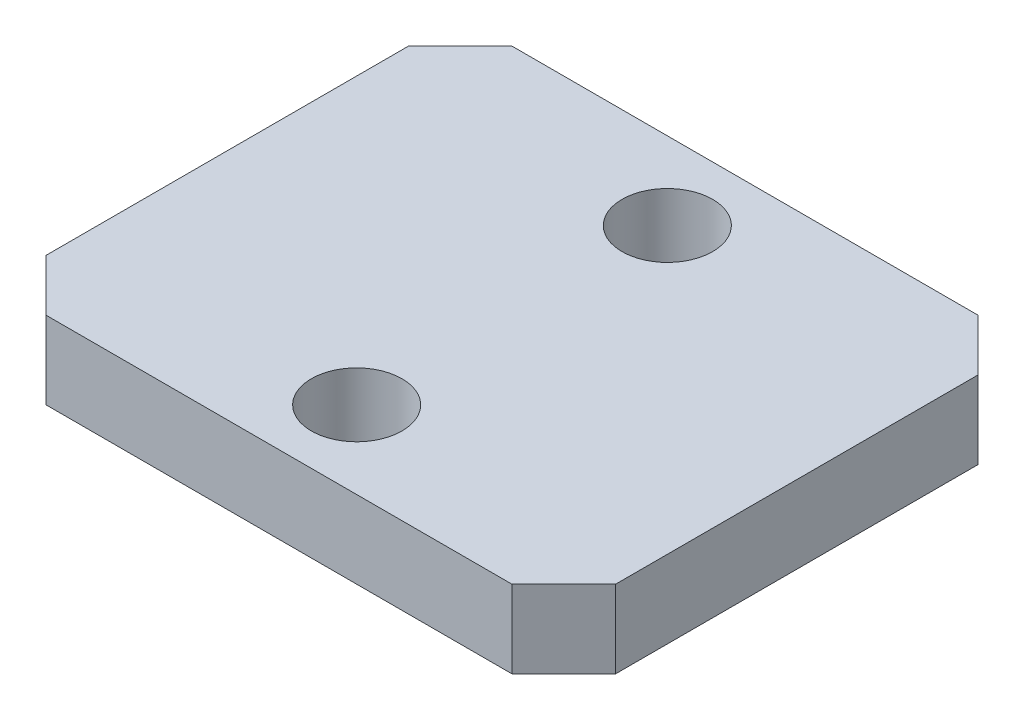
ISO-10303-21;
HEADER;
FILE_DESCRIPTION(('STEP AP214'),'2;1');
FILE_NAME('part.step','',(''),(''),'','','');
FILE_SCHEMA(('AUTOMOTIVE_DESIGN { 1 0 10303 214 1 1 1 1 }'));
ENDSEC;
DATA;
#1=APPLICATION_CONTEXT('core data for automotive mechanical design processes');
#2=APPLICATION_PROTOCOL_DEFINITION('international standard','automotive_design',2000,#1);
#3=PRODUCT_CONTEXT('',#1,'mechanical');
#4=PRODUCT('Part','Part','',(#3));
#5=PRODUCT_RELATED_PRODUCT_CATEGORY('part','',(#4));
#6=PRODUCT_DEFINITION_FORMATION('','',#4);
#7=PRODUCT_DEFINITION_CONTEXT('part definition',#1,'design');
#8=PRODUCT_DEFINITION('design','',#6,#7);
#9=PRODUCT_DEFINITION_SHAPE('','',#8);
#10=(LENGTH_UNIT() NAMED_UNIT(*) SI_UNIT(.MILLI.,.METRE.));
#11=(NAMED_UNIT(*) PLANE_ANGLE_UNIT() SI_UNIT($,.RADIAN.));
#12=(NAMED_UNIT(*) SI_UNIT($,.STERADIAN.) SOLID_ANGLE_UNIT());
#13=UNCERTAINTY_MEASURE_WITH_UNIT(LENGTH_MEASURE(1.E-05),#10,'distance_accuracy_value','');
#14=(GEOMETRIC_REPRESENTATION_CONTEXT(3) GLOBAL_UNCERTAINTY_ASSIGNED_CONTEXT((#13)) GLOBAL_UNIT_ASSIGNED_CONTEXT((#10,
#11,#12)) REPRESENTATION_CONTEXT('',''));
#15=CARTESIAN_POINT('',(0.,0.,0.));
#16=DIRECTION('',(0.,0.,1.));
#17=DIRECTION('',(1.,0.,0.));
#18=AXIS2_PLACEMENT_3D('',#15,#16,#17);
#19=CARTESIAN_POINT('',(11.,3.,9.));
#20=DIRECTION('',(-1.,0.,0.));
#21=DIRECTION('',(0.,0.,1.));
#22=AXIS2_PLACEMENT_3D('',#19,#20,#21);
#23=PLANE('',#22);
#24=DIRECTION('',(0.,0.,-1.));
#25=VECTOR('',#24,1.);
#26=CARTESIAN_POINT('',(11.,3.,9.));
#27=LINE('',#26,#25);
#28=CARTESIAN_POINT('',(11.,3.,7.));
#29=VERTEX_POINT('',#28);
#30=CARTESIAN_POINT('',(11.,3.,-6.99999999999999));
#31=VERTEX_POINT('',#30);
#32=EDGE_CURVE('E121',#29,#31,#27,.T.);
#33=ORIENTED_EDGE('',*,*,#32,.F.);
#34=DIRECTION('',(0.,-1.,0.));
#35=VECTOR('',#34,1.);
#36=CARTESIAN_POINT('',(11.,3.,7.));
#37=LINE('',#36,#35);
#38=CARTESIAN_POINT('',(11.,0.,7.));
#39=VERTEX_POINT('',#38);
#40=EDGE_CURVE('E106',#29,#39,#37,.T.);
#41=ORIENTED_EDGE('',*,*,#40,.T.);
#42=DIRECTION('',(0.,0.,-1.));
#43=VECTOR('',#42,1.);
#44=CARTESIAN_POINT('',(11.,0.,9.));
#45=LINE('',#44,#43);
#46=CARTESIAN_POINT('',(11.,0.,-6.99999999999999));
#47=VERTEX_POINT('',#46);
#48=EDGE_CURVE('E118',#39,#47,#45,.T.);
#49=ORIENTED_EDGE('',*,*,#48,.T.);
#50=DIRECTION('',(0.,1.,0.));
#51=VECTOR('',#50,1.);
#52=CARTESIAN_POINT('',(11.,3.,-6.99999999999999));
#53=LINE('',#52,#51);
#54=EDGE_CURVE('E123',#47,#31,#53,.T.);
#55=ORIENTED_EDGE('',*,*,#54,.T.);
#56=EDGE_LOOP('',(#33,#41,#49,#55));
#57=FACE_BOUND('',#56,.T.);
#58=ADVANCED_FACE('F35',(#57),#23,.F.);
#59=CARTESIAN_POINT('',(-11.,3.,-9.));
#60=DIRECTION('',(0.,0.,1.));
#61=DIRECTION('',(1.,0.,0.));
#62=AXIS2_PLACEMENT_3D('',#59,#60,#61);
#63=PLANE('',#62);
#64=DIRECTION('',(-1.,0.,0.));
#65=VECTOR('',#64,1.);
#66=CARTESIAN_POINT('',(-11.,3.,-9.));
#67=LINE('',#66,#65);
#68=CARTESIAN_POINT('',(9.,3.,-9.));
#69=VERTEX_POINT('',#68);
#70=CARTESIAN_POINT('',(-8.99999999999999,3.,-9.));
#71=VERTEX_POINT('',#70);
#72=EDGE_CURVE('E167',#69,#71,#67,.T.);
#73=ORIENTED_EDGE('',*,*,#72,.F.);
#74=DIRECTION('',(0.,-1.,0.));
#75=VECTOR('',#74,1.);
#76=CARTESIAN_POINT('',(9.,3.,-9.));
#77=LINE('',#76,#75);
#78=CARTESIAN_POINT('',(9.,0.,-9.));
#79=VERTEX_POINT('',#78);
#80=EDGE_CURVE('E160',#69,#79,#77,.T.);
#81=ORIENTED_EDGE('',*,*,#80,.T.);
#82=DIRECTION('',(-1.,0.,0.));
#83=VECTOR('',#82,1.);
#84=CARTESIAN_POINT('',(-11.,0.,-9.));
#85=LINE('',#84,#83);
#86=CARTESIAN_POINT('',(-8.99999999999999,0.,-9.));
#87=VERTEX_POINT('',#86);
#88=EDGE_CURVE('E127',#79,#87,#85,.T.);
#89=ORIENTED_EDGE('',*,*,#88,.T.);
#90=DIRECTION('',(0.,1.,0.));
#91=VECTOR('',#90,1.);
#92=CARTESIAN_POINT('',(-8.99999999999999,3.,-9.));
#93=LINE('',#92,#91);
#94=EDGE_CURVE('E158',#87,#71,#93,.T.);
#95=ORIENTED_EDGE('',*,*,#94,.T.);
#96=EDGE_LOOP('',(#73,#81,#89,#95));
#97=FACE_BOUND('',#96,.T.);
#98=ADVANCED_FACE('F165',(#97),#63,.F.);
#99=CARTESIAN_POINT('',(-11.,3.,9.));
#100=DIRECTION('',(1.,0.,0.));
#101=DIRECTION('',(0.,0.,-1.));
#102=AXIS2_PLACEMENT_3D('',#99,#100,#101);
#103=PLANE('',#102);
#104=DIRECTION('',(0.,0.,1.));
#105=VECTOR('',#104,1.);
#106=CARTESIAN_POINT('',(-11.,3.,9.));
#107=LINE('',#106,#105);
#108=CARTESIAN_POINT('',(-11.,3.,-6.99999999999999));
#109=VERTEX_POINT('',#108);
#110=CARTESIAN_POINT('',(-11.,3.,6.99999999999999));
#111=VERTEX_POINT('',#110);
#112=EDGE_CURVE('E175',#109,#111,#107,.T.);
#113=ORIENTED_EDGE('',*,*,#112,.F.);
#114=DIRECTION('',(0.,-1.,0.));
#115=VECTOR('',#114,1.);
#116=CARTESIAN_POINT('',(-11.,3.,-6.99999999999999));
#117=LINE('',#116,#115);
#118=CARTESIAN_POINT('',(-11.,0.,-6.99999999999999));
#119=VERTEX_POINT('',#118);
#120=EDGE_CURVE('E11',#109,#119,#117,.T.);
#121=ORIENTED_EDGE('',*,*,#120,.T.);
#122=DIRECTION('',(0.,0.,1.));
#123=VECTOR('',#122,1.);
#124=CARTESIAN_POINT('',(-11.,0.,9.));
#125=LINE('',#124,#123);
#126=CARTESIAN_POINT('',(-11.,0.,6.99999999999999));
#127=VERTEX_POINT('',#126);
#128=EDGE_CURVE('E131',#119,#127,#125,.T.);
#129=ORIENTED_EDGE('',*,*,#128,.T.);
#130=DIRECTION('',(0.,1.,0.));
#131=VECTOR('',#130,1.);
#132=CARTESIAN_POINT('',(-11.,3.,6.99999999999999));
#133=LINE('',#132,#131);
#134=EDGE_CURVE('E44',#127,#111,#133,.T.);
#135=ORIENTED_EDGE('',*,*,#134,.T.);
#136=EDGE_LOOP('',(#113,#121,#129,#135));
#137=FACE_BOUND('',#136,.T.);
#138=ADVANCED_FACE('F174',(#137),#103,.F.);
#139=CARTESIAN_POINT('',(-11.,3.,9.));
#140=DIRECTION('',(0.,0.,-1.));
#141=DIRECTION('',(-1.,0.,0.));
#142=AXIS2_PLACEMENT_3D('',#139,#140,#141);
#143=PLANE('',#142);
#144=DIRECTION('',(1.,0.,0.));
#145=VECTOR('',#144,1.);
#146=CARTESIAN_POINT('',(-11.,0.,9.));
#147=LINE('',#146,#145);
#148=CARTESIAN_POINT('',(-8.99999999999999,0.,9.));
#149=VERTEX_POINT('',#148);
#150=CARTESIAN_POINT('',(9.,0.,9.));
#151=VERTEX_POINT('',#150);
#152=EDGE_CURVE('E141',#149,#151,#147,.T.);
#153=ORIENTED_EDGE('',*,*,#152,.T.);
#154=DIRECTION('',(0.,1.,0.));
#155=VECTOR('',#154,1.);
#156=CARTESIAN_POINT('',(9.,3.,9.));
#157=LINE('',#156,#155);
#158=CARTESIAN_POINT('',(9.,3.,9.));
#159=VERTEX_POINT('',#158);
#160=EDGE_CURVE('E107',#151,#159,#157,.T.);
#161=ORIENTED_EDGE('',*,*,#160,.T.);
#162=DIRECTION('',(1.,0.,0.));
#163=VECTOR('',#162,1.);
#164=CARTESIAN_POINT('',(-11.,3.,9.));
#165=LINE('',#164,#163);
#166=CARTESIAN_POINT('',(-8.99999999999999,3.,9.));
#167=VERTEX_POINT('',#166);
#168=EDGE_CURVE('E137',#167,#159,#165,.T.);
#169=ORIENTED_EDGE('',*,*,#168,.F.);
#170=DIRECTION('',(0.,-1.,0.));
#171=VECTOR('',#170,1.);
#172=CARTESIAN_POINT('',(-8.99999999999999,3.,9.));
#173=LINE('',#172,#171);
#174=EDGE_CURVE('E112',#167,#149,#173,.T.);
#175=ORIENTED_EDGE('',*,*,#174,.T.);
#176=EDGE_LOOP('',(#153,#161,#169,#175));
#177=FACE_BOUND('',#176,.T.);
#178=ADVANCED_FACE('F202',(#177),#143,.F.);
#179=CARTESIAN_POINT('',(0.,3.,0.));
#180=DIRECTION('',(0.,-1.,0.));
#181=DIRECTION('',(0.,0.,-1.));
#182=AXIS2_PLACEMENT_3D('',#179,#180,#181);
#183=PLANE('',#182);
#184=CARTESIAN_POINT('',(0.,3.,-6.));
#185=DIRECTION('',(0.,-1.,0.));
#186=DIRECTION('',(0.,0.,-1.));
#187=AXIS2_PLACEMENT_3D('',#184,#185,#186);
#188=CIRCLE('',#187,1.75);
#189=CARTESIAN_POINT('',(0.,3.,-7.75));
#190=VERTEX_POINT('',#189);
#191=EDGE_CURVE('E128',#190,#190,#188,.F.);
#192=ORIENTED_EDGE('',*,*,#191,.F.);
#193=EDGE_LOOP('',(#192));
#194=FACE_BOUND('',#193,.T.);
#195=CARTESIAN_POINT('',(0.,3.,6.));
#196=DIRECTION('',(0.,-1.,0.));
#197=DIRECTION('',(0.,0.,-1.));
#198=AXIS2_PLACEMENT_3D('',#195,#196,#197);
#199=CIRCLE('',#198,1.75);
#200=CARTESIAN_POINT('',(0.,3.,4.25));
#201=VERTEX_POINT('',#200);
#202=EDGE_CURVE('E134',#201,#201,#199,.F.);
#203=ORIENTED_EDGE('',*,*,#202,.F.);
#204=EDGE_LOOP('',(#203));
#205=FACE_BOUND('',#204,.T.);
#206=ORIENTED_EDGE('',*,*,#168,.T.);
#207=DIRECTION('',(-0.707106781186549,0.,0.707106781186546));
#208=VECTOR('',#207,1.);
#209=CARTESIAN_POINT('',(11.,3.,7.));
#210=LINE('',#209,#208);
#211=EDGE_CURVE('E156',#159,#29,#210,.F.);
#212=ORIENTED_EDGE('',*,*,#211,.T.);
#213=ORIENTED_EDGE('',*,*,#32,.T.);
#214=DIRECTION('',(0.707106781186546,0.,0.707106781186549));
#215=VECTOR('',#214,1.);
#216=CARTESIAN_POINT('',(9.,3.,-9.));
#217=LINE('',#216,#215);
#218=EDGE_CURVE('E154',#31,#69,#217,.F.);
#219=ORIENTED_EDGE('',*,*,#218,.T.);
#220=ORIENTED_EDGE('',*,*,#72,.T.);
#221=DIRECTION('',(0.707106781186548,0.,-0.707106781186547));
#222=VECTOR('',#221,1.);
#223=CARTESIAN_POINT('',(-11.,3.,-6.99999999999999));
#224=LINE('',#223,#222);
#225=EDGE_CURVE('E57',#71,#109,#224,.F.);
#226=ORIENTED_EDGE('',*,*,#225,.T.);
#227=ORIENTED_EDGE('',*,*,#112,.T.);
#228=DIRECTION('',(-0.707106781186546,0.,-0.707106781186549));
#229=VECTOR('',#228,1.);
#230=CARTESIAN_POINT('',(-8.99999999999999,3.,9.));
#231=LINE('',#230,#229);
#232=EDGE_CURVE('E151',#111,#167,#231,.F.);
#233=ORIENTED_EDGE('',*,*,#232,.T.);
#234=EDGE_LOOP('',(#206,#212,#213,#219,#220,#226,#227,#233));
#235=FACE_BOUND('',#234,.T.);
#236=ADVANCED_FACE('F199',(#194,#205,#235),#183,.F.);
#237=CARTESIAN_POINT('',(0.,0.,0.));
#238=DIRECTION('',(0.,-1.,0.));
#239=DIRECTION('',(0.,0.,-1.));
#240=AXIS2_PLACEMENT_3D('',#237,#238,#239);
#241=PLANE('',#240);
#242=CARTESIAN_POINT('',(0.,0.,-6.));
#243=DIRECTION('',(0.,-1.,0.));
#244=DIRECTION('',(0.,0.,-1.));
#245=AXIS2_PLACEMENT_3D('',#242,#243,#244);
#246=CIRCLE('',#245,1.75);
#247=CARTESIAN_POINT('',(0.,0.,-7.75));
#248=VERTEX_POINT('',#247);
#249=EDGE_CURVE('E183',#248,#248,#246,.F.);
#250=ORIENTED_EDGE('',*,*,#249,.T.);
#251=EDGE_LOOP('',(#250));
#252=FACE_BOUND('',#251,.T.);
#253=CARTESIAN_POINT('',(0.,0.,6.));
#254=DIRECTION('',(0.,-1.,0.));
#255=DIRECTION('',(0.,0.,-1.));
#256=AXIS2_PLACEMENT_3D('',#253,#254,#255);
#257=CIRCLE('',#256,1.75);
#258=CARTESIAN_POINT('',(0.,0.,4.25));
#259=VERTEX_POINT('',#258);
#260=EDGE_CURVE('E184',#259,#259,#257,.F.);
#261=ORIENTED_EDGE('',*,*,#260,.T.);
#262=EDGE_LOOP('',(#261));
#263=FACE_BOUND('',#262,.T.);
#264=ORIENTED_EDGE('',*,*,#48,.F.);
#265=DIRECTION('',(0.707106781186549,0.,-0.707106781186546));
#266=VECTOR('',#265,1.);
#267=CARTESIAN_POINT('',(8.99999999999998,0.,9.00000000000001));
#268=LINE('',#267,#266);
#269=EDGE_CURVE('E102',#39,#151,#268,.F.);
#270=ORIENTED_EDGE('',*,*,#269,.T.);
#271=ORIENTED_EDGE('',*,*,#152,.F.);
#272=DIRECTION('',(0.707106781186546,0.,0.707106781186549));
#273=VECTOR('',#272,1.);
#274=CARTESIAN_POINT('',(-9.00000000000001,0.,8.99999999999998));
#275=LINE('',#274,#273);
#276=EDGE_CURVE('E122',#149,#127,#275,.F.);
#277=ORIENTED_EDGE('',*,*,#276,.T.);
#278=ORIENTED_EDGE('',*,*,#128,.F.);
#279=DIRECTION('',(-0.707106781186548,0.,0.707106781186547));
#280=VECTOR('',#279,1.);
#281=CARTESIAN_POINT('',(-8.99999999999998,0.,-9.));
#282=LINE('',#281,#280);
#283=EDGE_CURVE('E145',#119,#87,#282,.F.);
#284=ORIENTED_EDGE('',*,*,#283,.T.);
#285=ORIENTED_EDGE('',*,*,#88,.F.);
#286=DIRECTION('',(-0.707106781186546,0.,-0.707106781186549));
#287=VECTOR('',#286,1.);
#288=CARTESIAN_POINT('',(9.00000000000002,0.,-8.99999999999998));
#289=LINE('',#288,#287);
#290=EDGE_CURVE('E113',#79,#47,#289,.F.);
#291=ORIENTED_EDGE('',*,*,#290,.T.);
#292=EDGE_LOOP('',(#264,#270,#271,#277,#278,#284,#285,#291));
#293=FACE_BOUND('',#292,.T.);
#294=ADVANCED_FACE('F125',(#252,#263,#293),#241,.T.);
#295=CARTESIAN_POINT('',(0.,3.000012,6.));
#296=DIRECTION('',(0.,-1.,0.));
#297=DIRECTION('',(0.,0.,-1.));
#298=AXIS2_PLACEMENT_3D('',#295,#296,#297);
#299=CYLINDRICAL_SURFACE('',#298,1.75);
#300=ORIENTED_EDGE('',*,*,#260,.F.);
#301=EDGE_LOOP('',(#300));
#302=FACE_BOUND('',#301,.T.);
#303=ORIENTED_EDGE('',*,*,#202,.T.);
#304=EDGE_LOOP('',(#303));
#305=FACE_BOUND('',#304,.T.);
#306=ADVANCED_FACE('F195',(#302,#305),#299,.F.);
#307=CARTESIAN_POINT('',(0.,3.000012,-6.));
#308=DIRECTION('',(0.,-1.,0.));
#309=DIRECTION('',(0.,0.,-1.));
#310=AXIS2_PLACEMENT_3D('',#307,#308,#309);
#311=CYLINDRICAL_SURFACE('',#310,1.75);
#312=ORIENTED_EDGE('',*,*,#249,.F.);
#313=EDGE_LOOP('',(#312));
#314=FACE_BOUND('',#313,.T.);
#315=ORIENTED_EDGE('',*,*,#191,.T.);
#316=EDGE_LOOP('',(#315));
#317=FACE_BOUND('',#316,.T.);
#318=ADVANCED_FACE('F192',(#314,#317),#311,.F.);
#319=CARTESIAN_POINT('',(11.,3.,7.));
#320=DIRECTION('',(-0.707106781186546,0.,-0.707106781186549));
#321=DIRECTION('',(0.,-1.,0.));
#322=AXIS2_PLACEMENT_3D('',#319,#320,#321);
#323=PLANE('',#322);
#324=ORIENTED_EDGE('',*,*,#211,.F.);
#325=ORIENTED_EDGE('',*,*,#160,.F.);
#326=ORIENTED_EDGE('',*,*,#269,.F.);
#327=ORIENTED_EDGE('',*,*,#40,.F.);
#328=EDGE_LOOP('',(#324,#325,#326,#327));
#329=FACE_BOUND('',#328,.T.);
#330=ADVANCED_FACE('F105',(#329),#323,.F.);
#331=CARTESIAN_POINT('',(9.,3.,-9.));
#332=DIRECTION('',(-0.707106781186549,0.,0.707106781186546));
#333=DIRECTION('',(0.,-1.,0.));
#334=AXIS2_PLACEMENT_3D('',#331,#332,#333);
#335=PLANE('',#334);
#336=ORIENTED_EDGE('',*,*,#218,.F.);
#337=ORIENTED_EDGE('',*,*,#54,.F.);
#338=ORIENTED_EDGE('',*,*,#290,.F.);
#339=ORIENTED_EDGE('',*,*,#80,.F.);
#340=EDGE_LOOP('',(#336,#337,#338,#339));
#341=FACE_BOUND('',#340,.T.);
#342=ADVANCED_FACE('F213',(#341),#335,.F.);
#343=CARTESIAN_POINT('',(-11.,3.,-6.99999999999999));
#344=DIRECTION('',(0.707106781186547,0.,0.707106781186548));
#345=DIRECTION('',(0.,-1.,0.));
#346=AXIS2_PLACEMENT_3D('',#343,#344,#345);
#347=PLANE('',#346);
#348=ORIENTED_EDGE('',*,*,#225,.F.);
#349=ORIENTED_EDGE('',*,*,#94,.F.);
#350=ORIENTED_EDGE('',*,*,#283,.F.);
#351=ORIENTED_EDGE('',*,*,#120,.F.);
#352=EDGE_LOOP('',(#348,#349,#350,#351));
#353=FACE_BOUND('',#352,.T.);
#354=ADVANCED_FACE('F173',(#353),#347,.F.);
#355=CARTESIAN_POINT('',(-8.99999999999999,3.,9.));
#356=DIRECTION('',(0.707106781186549,0.,-0.707106781186546));
#357=DIRECTION('',(0.,-1.,0.));
#358=AXIS2_PLACEMENT_3D('',#355,#356,#357);
#359=PLANE('',#358);
#360=ORIENTED_EDGE('',*,*,#232,.F.);
#361=ORIENTED_EDGE('',*,*,#134,.F.);
#362=ORIENTED_EDGE('',*,*,#276,.F.);
#363=ORIENTED_EDGE('',*,*,#174,.F.);
#364=EDGE_LOOP('',(#360,#361,#362,#363));
#365=FACE_BOUND('',#364,.T.);
#366=ADVANCED_FACE('F38',(#365),#359,.F.);
#367=CLOSED_SHELL('',(#58,#98,#138,#178,#236,#294,#306,#318,#330,#342,#354,#366));
#368=MANIFOLD_SOLID_BREP('B2',#367);
#369=ADVANCED_BREP_SHAPE_REPRESENTATION('',(#18,#368),#14);
#370=SHAPE_DEFINITION_REPRESENTATION(#9,#369);
ENDSEC;
END-ISO-10303-21;
